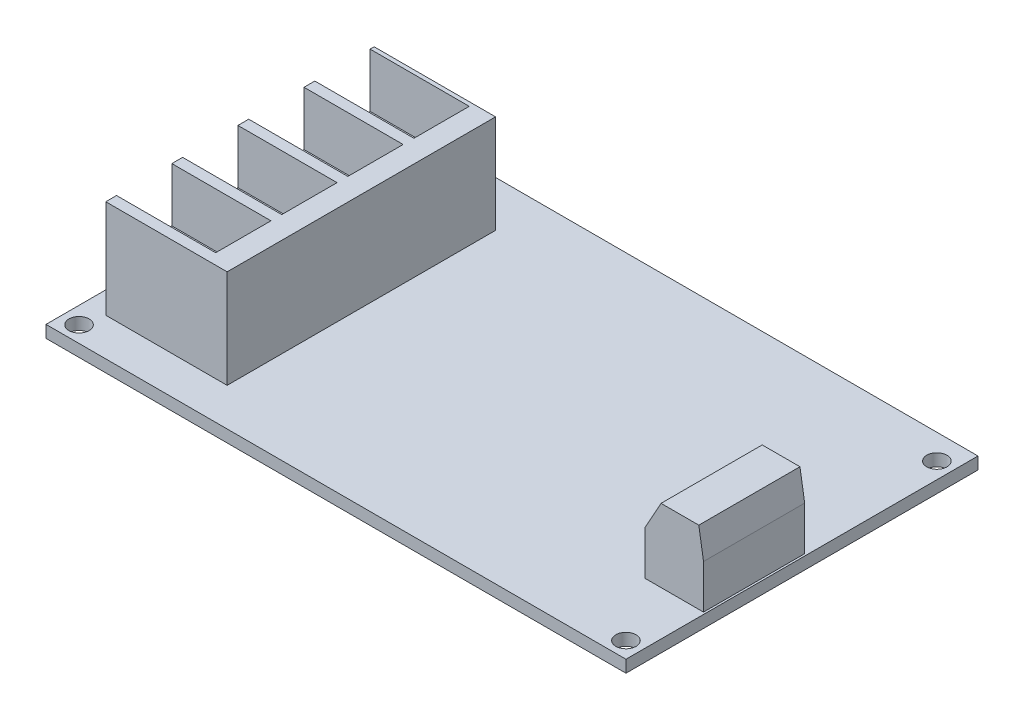
ISO-10303-21;
HEADER;
FILE_DESCRIPTION(('STEP AP214'),'2;1');
FILE_NAME('part.step','',(''),(''),'','','');
FILE_SCHEMA(('AUTOMOTIVE_DESIGN { 1 0 10303 214 1 1 1 1 }'));
ENDSEC;
DATA;
#1=APPLICATION_CONTEXT('core data for automotive mechanical design processes');
#2=APPLICATION_PROTOCOL_DEFINITION('international standard','automotive_design',2000,#1);
#3=PRODUCT_CONTEXT('',#1,'mechanical');
#4=PRODUCT('Part','Part','',(#3));
#5=PRODUCT_RELATED_PRODUCT_CATEGORY('part','',(#4));
#6=PRODUCT_DEFINITION_FORMATION('','',#4);
#7=PRODUCT_DEFINITION_CONTEXT('part definition',#1,'design');
#8=PRODUCT_DEFINITION('design','',#6,#7);
#9=PRODUCT_DEFINITION_SHAPE('','',#8);
#10=(LENGTH_UNIT() NAMED_UNIT(*) SI_UNIT(.MILLI.,.METRE.));
#11=(NAMED_UNIT(*) PLANE_ANGLE_UNIT() SI_UNIT($,.RADIAN.));
#12=(NAMED_UNIT(*) SI_UNIT($,.STERADIAN.) SOLID_ANGLE_UNIT());
#13=UNCERTAINTY_MEASURE_WITH_UNIT(LENGTH_MEASURE(1.E-05),#10,'distance_accuracy_value','');
#14=(GEOMETRIC_REPRESENTATION_CONTEXT(3) GLOBAL_UNCERTAINTY_ASSIGNED_CONTEXT((#13)) GLOBAL_UNIT_ASSIGNED_CONTEXT((#10,
#11,#12)) REPRESENTATION_CONTEXT('',''));
#15=CARTESIAN_POINT('',(0.,0.,0.));
#16=DIRECTION('',(0.,0.,1.));
#17=DIRECTION('',(1.,0.,0.));
#18=AXIS2_PLACEMENT_3D('',#15,#16,#17);
#19=CARTESIAN_POINT('',(3.26,16.38,-45.4));
#20=DIRECTION('',(1.,0.,0.));
#21=DIRECTION('',(0.,0.,-1.));
#22=AXIS2_PLACEMENT_3D('',#19,#20,#21);
#23=PLANE('',#22);
#24=DIRECTION('',(0.,0.,1.));
#25=VECTOR('',#24,1.);
#26=CARTESIAN_POINT('',(3.26,8.38,-7.2));
#27=LINE('',#26,#25);
#28=CARTESIAN_POINT('',(3.26,8.38,-15.4));
#29=VERTEX_POINT('',#28);
#30=CARTESIAN_POINT('',(3.26,8.38,-7.2));
#31=VERTEX_POINT('',#30);
#32=EDGE_CURVE('E201',#29,#31,#27,.T.);
#33=ORIENTED_EDGE('',*,*,#32,.F.);
#34=DIRECTION('',(0.,1.,0.));
#35=VECTOR('',#34,1.);
#36=CARTESIAN_POINT('',(3.26,8.38,-15.4));
#37=LINE('',#36,#35);
#38=CARTESIAN_POINT('',(3.26,16.38,-15.4));
#39=VERTEX_POINT('',#38);
#40=EDGE_CURVE('E320',#29,#39,#37,.T.);
#41=ORIENTED_EDGE('',*,*,#40,.T.);
#42=DIRECTION('',(0.,0.,1.));
#43=VECTOR('',#42,1.);
#44=CARTESIAN_POINT('',(3.26,16.38,-45.4));
#45=LINE('',#44,#43);
#46=CARTESIAN_POINT('',(3.25999999999997,16.38,-17.));
#47=VERTEX_POINT('',#46);
#48=EDGE_CURVE('E562',#47,#39,#45,.T.);
#49=ORIENTED_EDGE('',*,*,#48,.F.);
#50=DIRECTION('',(0.,1.,0.));
#51=VECTOR('',#50,1.);
#52=CARTESIAN_POINT('',(3.25999999999997,8.38,-17.));
#53=LINE('',#52,#51);
#54=CARTESIAN_POINT('',(3.25999999999997,8.38,-17.));
#55=VERTEX_POINT('',#54);
#56=EDGE_CURVE('E229',#55,#47,#53,.T.);
#57=ORIENTED_EDGE('',*,*,#56,.F.);
#58=DIRECTION('',(0.,0.,1.));
#59=VECTOR('',#58,1.);
#60=CARTESIAN_POINT('',(3.25999999999997,8.38,-17.));
#61=LINE('',#60,#59);
#62=CARTESIAN_POINT('',(3.25999999999997,8.38,-25.2));
#63=VERTEX_POINT('',#62);
#64=EDGE_CURVE('E223',#63,#55,#61,.T.);
#65=ORIENTED_EDGE('',*,*,#64,.F.);
#66=DIRECTION('',(0.,1.,0.));
#67=VECTOR('',#66,1.);
#68=CARTESIAN_POINT('',(3.25999999999997,8.38,-25.2));
#69=LINE('',#68,#67);
#70=CARTESIAN_POINT('',(3.25999999999997,16.38,-25.2));
#71=VERTEX_POINT('',#70);
#72=EDGE_CURVE('E226',#63,#71,#69,.T.);
#73=ORIENTED_EDGE('',*,*,#72,.T.);
#74=CARTESIAN_POINT('',(3.25999999999993,16.38,-26.8));
#75=VERTEX_POINT('',#74);
#76=EDGE_CURVE('E565',#75,#71,#45,.T.);
#77=ORIENTED_EDGE('',*,*,#76,.F.);
#78=DIRECTION('',(0.,1.,0.));
#79=VECTOR('',#78,1.);
#80=CARTESIAN_POINT('',(3.25999999999993,8.38,-26.8));
#81=LINE('',#80,#79);
#82=CARTESIAN_POINT('',(3.25999999999993,8.38,-26.8));
#83=VERTEX_POINT('',#82);
#84=EDGE_CURVE('E257',#83,#75,#81,.T.);
#85=ORIENTED_EDGE('',*,*,#84,.F.);
#86=DIRECTION('',(0.,0.,1.));
#87=VECTOR('',#86,1.);
#88=CARTESIAN_POINT('',(3.25999999999993,8.38,-26.8));
#89=LINE('',#88,#87);
#90=CARTESIAN_POINT('',(3.25999999999993,8.38,-35.));
#91=VERTEX_POINT('',#90);
#92=EDGE_CURVE('E251',#91,#83,#89,.T.);
#93=ORIENTED_EDGE('',*,*,#92,.F.);
#94=DIRECTION('',(0.,1.,0.));
#95=VECTOR('',#94,1.);
#96=CARTESIAN_POINT('',(3.25999999999993,8.38,-35.));
#97=LINE('',#96,#95);
#98=CARTESIAN_POINT('',(3.25999999999993,16.38,-35.));
#99=VERTEX_POINT('',#98);
#100=EDGE_CURVE('E254',#91,#99,#97,.T.);
#101=ORIENTED_EDGE('',*,*,#100,.T.);
#102=CARTESIAN_POINT('',(3.2599999999999,16.38,-36.6));
#103=VERTEX_POINT('',#102);
#104=EDGE_CURVE('E309',#103,#99,#45,.T.);
#105=ORIENTED_EDGE('',*,*,#104,.F.);
#106=DIRECTION('',(0.,1.,0.));
#107=VECTOR('',#106,1.);
#108=CARTESIAN_POINT('',(3.2599999999999,8.38,-36.6));
#109=LINE('',#108,#107);
#110=CARTESIAN_POINT('',(3.2599999999999,8.38,-36.6));
#111=VERTEX_POINT('',#110);
#112=EDGE_CURVE('E286',#111,#103,#109,.T.);
#113=ORIENTED_EDGE('',*,*,#112,.F.);
#114=DIRECTION('',(0.,0.,1.));
#115=VECTOR('',#114,1.);
#116=CARTESIAN_POINT('',(3.2599999999999,8.38,-36.6));
#117=LINE('',#116,#115);
#118=CARTESIAN_POINT('',(3.2599999999999,8.38,-44.8));
#119=VERTEX_POINT('',#118);
#120=EDGE_CURVE('E280',#119,#111,#117,.T.);
#121=ORIENTED_EDGE('',*,*,#120,.F.);
#122=DIRECTION('',(0.,1.,0.));
#123=VECTOR('',#122,1.);
#124=CARTESIAN_POINT('',(3.2599999999999,8.38,-44.8));
#125=LINE('',#124,#123);
#126=CARTESIAN_POINT('',(3.2599999999999,16.38,-44.8));
#127=VERTEX_POINT('',#126);
#128=EDGE_CURVE('E283',#119,#127,#125,.T.);
#129=ORIENTED_EDGE('',*,*,#128,.T.);
#130=CARTESIAN_POINT('',(3.26,16.38,-45.4));
#131=VERTEX_POINT('',#130);
#132=EDGE_CURVE('E305',#131,#127,#45,.T.);
#133=ORIENTED_EDGE('',*,*,#132,.F.);
#134=DIRECTION('',(0.,-1.,0.));
#135=VECTOR('',#134,1.);
#136=CARTESIAN_POINT('',(3.26,16.38,-45.4));
#137=LINE('',#136,#135);
#138=CARTESIAN_POINT('',(3.26,1.8,-45.4));
#139=VERTEX_POINT('',#138);
#140=EDGE_CURVE('E315',#131,#139,#137,.T.);
#141=ORIENTED_EDGE('',*,*,#140,.T.);
#142=DIRECTION('',(0.,0.,1.));
#143=VECTOR('',#142,1.);
#144=CARTESIAN_POINT('',(3.26,1.8,-45.4));
#145=LINE('',#144,#143);
#146=CARTESIAN_POINT('',(3.26,1.8,-5.6));
#147=VERTEX_POINT('',#146);
#148=EDGE_CURVE('E316',#139,#147,#145,.T.);
#149=ORIENTED_EDGE('',*,*,#148,.T.);
#150=DIRECTION('',(0.,-1.,0.));
#151=VECTOR('',#150,1.);
#152=CARTESIAN_POINT('',(3.26,16.38,-5.6));
#153=LINE('',#152,#151);
#154=CARTESIAN_POINT('',(3.26,16.38,-5.6));
#155=VERTEX_POINT('',#154);
#156=EDGE_CURVE('E12',#155,#147,#153,.T.);
#157=ORIENTED_EDGE('',*,*,#156,.F.);
#158=CARTESIAN_POINT('',(3.26,16.38,-7.20000000000001));
#159=VERTEX_POINT('',#158);
#160=EDGE_CURVE('E214',#159,#155,#45,.T.);
#161=ORIENTED_EDGE('',*,*,#160,.F.);
#162=DIRECTION('',(0.,1.,0.));
#163=VECTOR('',#162,1.);
#164=CARTESIAN_POINT('',(3.26,8.38,-7.2));
#165=LINE('',#164,#163);
#166=EDGE_CURVE('E194',#31,#159,#165,.T.);
#167=ORIENTED_EDGE('',*,*,#166,.F.);
#168=EDGE_LOOP('',(#33,#41,#49,#57,#65,#73,#77,#85,#93,#101,#105,#113,#121,#129,#133,#141,#149,
#157,#161,#167));
#169=FACE_BOUND('',#168,.T.);
#170=ADVANCED_FACE('F54',(#169),#23,.F.);
#171=CARTESIAN_POINT('',(3.26,16.38,-5.6));
#172=DIRECTION('',(0.,0.,-1.));
#173=DIRECTION('',(-1.,0.,0.));
#174=AXIS2_PLACEMENT_3D('',#171,#172,#173);
#175=PLANE('',#174);
#176=DIRECTION('',(1.,0.,0.));
#177=VECTOR('',#176,1.);
#178=CARTESIAN_POINT('',(3.26,1.8,-5.6));
#179=LINE('',#178,#177);
#180=CARTESIAN_POINT('',(21.26,1.8,-5.6));
#181=VERTEX_POINT('',#180);
#182=EDGE_CURVE('E319',#147,#181,#179,.T.);
#183=ORIENTED_EDGE('',*,*,#182,.T.);
#184=DIRECTION('',(0.,-1.,0.));
#185=VECTOR('',#184,1.);
#186=CARTESIAN_POINT('',(21.26,16.38,-5.6));
#187=LINE('',#186,#185);
#188=CARTESIAN_POINT('',(21.26,16.38,-5.6));
#189=VERTEX_POINT('',#188);
#190=EDGE_CURVE('E61',#189,#181,#187,.T.);
#191=ORIENTED_EDGE('',*,*,#190,.F.);
#192=DIRECTION('',(1.,0.,0.));
#193=VECTOR('',#192,1.);
#194=CARTESIAN_POINT('',(3.26,16.38,-5.6));
#195=LINE('',#194,#193);
#196=EDGE_CURVE('E308',#155,#189,#195,.T.);
#197=ORIENTED_EDGE('',*,*,#196,.F.);
#198=ORIENTED_EDGE('',*,*,#156,.T.);
#199=EDGE_LOOP('',(#183,#191,#197,#198));
#200=FACE_BOUND('',#199,.T.);
#201=ADVANCED_FACE('F354',(#200),#175,.F.);
#202=CARTESIAN_POINT('',(21.26,16.38,-45.4));
#203=DIRECTION('',(-1.,0.,0.));
#204=DIRECTION('',(0.,0.,1.));
#205=AXIS2_PLACEMENT_3D('',#202,#203,#204);
#206=PLANE('',#205);
#207=DIRECTION('',(0.,0.,-1.));
#208=VECTOR('',#207,1.);
#209=CARTESIAN_POINT('',(21.26,1.8,-45.4));
#210=LINE('',#209,#208);
#211=CARTESIAN_POINT('',(21.26,1.8,-45.4));
#212=VERTEX_POINT('',#211);
#213=EDGE_CURVE('E322',#181,#212,#210,.T.);
#214=ORIENTED_EDGE('',*,*,#213,.T.);
#215=DIRECTION('',(0.,-1.,0.));
#216=VECTOR('',#215,1.);
#217=CARTESIAN_POINT('',(21.26,16.38,-45.4));
#218=LINE('',#217,#216);
#219=CARTESIAN_POINT('',(21.26,16.38,-45.4));
#220=VERTEX_POINT('',#219);
#221=EDGE_CURVE('E328',#220,#212,#218,.T.);
#222=ORIENTED_EDGE('',*,*,#221,.F.);
#223=DIRECTION('',(0.,0.,-1.));
#224=VECTOR('',#223,1.);
#225=CARTESIAN_POINT('',(21.26,16.38,-45.4));
#226=LINE('',#225,#224);
#227=EDGE_CURVE('E311',#189,#220,#226,.T.);
#228=ORIENTED_EDGE('',*,*,#227,.F.);
#229=ORIENTED_EDGE('',*,*,#190,.T.);
#230=EDGE_LOOP('',(#214,#222,#228,#229));
#231=FACE_BOUND('',#230,.T.);
#232=ADVANCED_FACE('F335',(#231),#206,.F.);
#233=CARTESIAN_POINT('',(3.26,16.38,-45.4));
#234=DIRECTION('',(0.,0.,1.));
#235=DIRECTION('',(1.,0.,0.));
#236=AXIS2_PLACEMENT_3D('',#233,#234,#235);
#237=PLANE('',#236);
#238=DIRECTION('',(-1.,0.,0.));
#239=VECTOR('',#238,1.);
#240=CARTESIAN_POINT('',(3.26,1.8,-45.4));
#241=LINE('',#240,#239);
#242=EDGE_CURVE('E324',#212,#139,#241,.T.);
#243=ORIENTED_EDGE('',*,*,#242,.T.);
#244=ORIENTED_EDGE('',*,*,#140,.F.);
#245=DIRECTION('',(-1.,0.,0.));
#246=VECTOR('',#245,1.);
#247=CARTESIAN_POINT('',(3.26,16.38,-45.4));
#248=LINE('',#247,#246);
#249=EDGE_CURVE('E313',#220,#131,#248,.T.);
#250=ORIENTED_EDGE('',*,*,#249,.F.);
#251=ORIENTED_EDGE('',*,*,#221,.T.);
#252=EDGE_LOOP('',(#243,#244,#250,#251));
#253=FACE_BOUND('',#252,.T.);
#254=ADVANCED_FACE('F345',(#253),#237,.F.);
#255=CARTESIAN_POINT('',(0.,16.38,0.));
#256=DIRECTION('',(0.,1.,0.));
#257=DIRECTION('',(0.,0.,1.));
#258=AXIS2_PLACEMENT_3D('',#255,#256,#257);
#259=PLANE('',#258);
#260=DIRECTION('',(-1.,0.,0.));
#261=VECTOR('',#260,1.);
#262=CARTESIAN_POINT('',(3.26,16.38,-15.4));
#263=LINE('',#262,#261);
#264=CARTESIAN_POINT('',(17.96,16.38,-15.4));
#265=VERTEX_POINT('',#264);
#266=EDGE_CURVE('E210',#265,#39,#263,.T.);
#267=ORIENTED_EDGE('',*,*,#266,.F.);
#268=DIRECTION('',(0.,0.,-1.));
#269=VECTOR('',#268,1.);
#270=CARTESIAN_POINT('',(17.96,16.38,-7.2));
#271=LINE('',#270,#269);
#272=CARTESIAN_POINT('',(17.96,16.38,-7.2));
#273=VERTEX_POINT('',#272);
#274=EDGE_CURVE('E558',#273,#265,#271,.T.);
#275=ORIENTED_EDGE('',*,*,#274,.F.);
#276=DIRECTION('',(1.,0.,0.));
#277=VECTOR('',#276,1.);
#278=CARTESIAN_POINT('',(3.26,16.38,-7.2));
#279=LINE('',#278,#277);
#280=EDGE_CURVE('E238',#159,#273,#279,.T.);
#281=ORIENTED_EDGE('',*,*,#280,.F.);
#282=ORIENTED_EDGE('',*,*,#160,.T.);
#283=ORIENTED_EDGE('',*,*,#196,.T.);
#284=ORIENTED_EDGE('',*,*,#227,.T.);
#285=ORIENTED_EDGE('',*,*,#249,.T.);
#286=ORIENTED_EDGE('',*,*,#132,.T.);
#287=DIRECTION('',(-1.,0.,0.));
#288=VECTOR('',#287,1.);
#289=CARTESIAN_POINT('',(3.2599999999999,16.38,-44.8));
#290=LINE('',#289,#288);
#291=CARTESIAN_POINT('',(17.9599999999999,16.38,-44.8));
#292=VERTEX_POINT('',#291);
#293=EDGE_CURVE('E288',#292,#127,#290,.T.);
#294=ORIENTED_EDGE('',*,*,#293,.F.);
#295=DIRECTION('',(0.,0.,-1.));
#296=VECTOR('',#295,1.);
#297=CARTESIAN_POINT('',(17.9599999999999,16.38,-36.6));
#298=LINE('',#297,#296);
#299=CARTESIAN_POINT('',(17.9599999999999,16.38,-36.6));
#300=VERTEX_POINT('',#299);
#301=EDGE_CURVE('E290',#300,#292,#298,.T.);
#302=ORIENTED_EDGE('',*,*,#301,.F.);
#303=DIRECTION('',(1.,0.,0.));
#304=VECTOR('',#303,1.);
#305=CARTESIAN_POINT('',(3.2599999999999,16.38,-36.6));
#306=LINE('',#305,#304);
#307=EDGE_CURVE('E259',#103,#300,#306,.T.);
#308=ORIENTED_EDGE('',*,*,#307,.F.);
#309=ORIENTED_EDGE('',*,*,#104,.T.);
#310=DIRECTION('',(-1.,0.,0.));
#311=VECTOR('',#310,1.);
#312=CARTESIAN_POINT('',(3.25999999999993,16.38,-35.));
#313=LINE('',#312,#311);
#314=CARTESIAN_POINT('',(17.9599999999999,16.38,-35.));
#315=VERTEX_POINT('',#314);
#316=EDGE_CURVE('E260',#315,#99,#313,.T.);
#317=ORIENTED_EDGE('',*,*,#316,.F.);
#318=DIRECTION('',(0.,0.,-1.));
#319=VECTOR('',#318,1.);
#320=CARTESIAN_POINT('',(17.9599999999999,16.38,-26.8));
#321=LINE('',#320,#319);
#322=CARTESIAN_POINT('',(17.9599999999999,16.38,-26.8));
#323=VERTEX_POINT('',#322);
#324=EDGE_CURVE('E262',#323,#315,#321,.T.);
#325=ORIENTED_EDGE('',*,*,#324,.F.);
#326=DIRECTION('',(1.,0.,0.));
#327=VECTOR('',#326,1.);
#328=CARTESIAN_POINT('',(3.25999999999993,16.38,-26.8));
#329=LINE('',#328,#327);
#330=EDGE_CURVE('E76',#75,#323,#329,.T.);
#331=ORIENTED_EDGE('',*,*,#330,.F.);
#332=ORIENTED_EDGE('',*,*,#76,.T.);
#333=DIRECTION('',(-1.,0.,0.));
#334=VECTOR('',#333,1.);
#335=CARTESIAN_POINT('',(3.25999999999997,16.38,-25.2));
#336=LINE('',#335,#334);
#337=CARTESIAN_POINT('',(17.96,16.38,-25.2));
#338=VERTEX_POINT('',#337);
#339=EDGE_CURVE('E231',#338,#71,#336,.T.);
#340=ORIENTED_EDGE('',*,*,#339,.F.);
#341=DIRECTION('',(0.,0.,-1.));
#342=VECTOR('',#341,1.);
#343=CARTESIAN_POINT('',(17.96,16.38,-17.));
#344=LINE('',#343,#342);
#345=CARTESIAN_POINT('',(17.96,16.38,-17.));
#346=VERTEX_POINT('',#345);
#347=EDGE_CURVE('E233',#346,#338,#344,.T.);
#348=ORIENTED_EDGE('',*,*,#347,.F.);
#349=DIRECTION('',(1.,0.,0.));
#350=VECTOR('',#349,1.);
#351=CARTESIAN_POINT('',(3.25999999999997,16.38,-17.));
#352=LINE('',#351,#350);
#353=EDGE_CURVE('E68',#47,#346,#352,.T.);
#354=ORIENTED_EDGE('',*,*,#353,.F.);
#355=ORIENTED_EDGE('',*,*,#48,.T.);
#356=EDGE_LOOP('',(#267,#275,#281,#282,#283,#284,#285,#286,#294,#302,#308,#309,#317,#325,#331,
#332,#340,#348,#354,#355));
#357=FACE_BOUND('',#356,.T.);
#358=ADVANCED_FACE('F352',(#357),#259,.T.);
#359=CARTESIAN_POINT('',(0.,1.8,0.));
#360=DIRECTION('',(0.,1.,0.));
#361=DIRECTION('',(0.,0.,1.));
#362=AXIS2_PLACEMENT_3D('',#359,#360,#361);
#363=PLANE('',#362);
#364=ORIENTED_EDGE('',*,*,#148,.F.);
#365=ORIENTED_EDGE('',*,*,#242,.F.);
#366=ORIENTED_EDGE('',*,*,#213,.F.);
#367=ORIENTED_EDGE('',*,*,#182,.F.);
#368=EDGE_LOOP('',(#364,#365,#366,#367));
#369=FACE_BOUND('',#368,.T.);
#370=ADVANCED_FACE('F342',(#369),#363,.F.);
#371=CARTESIAN_POINT('',(3.2599999999999,8.38,-36.6));
#372=DIRECTION('',(0.,0.,1.));
#373=DIRECTION('',(1.,0.,0.));
#374=AXIS2_PLACEMENT_3D('',#371,#372,#373);
#375=PLANE('',#374);
#376=ORIENTED_EDGE('',*,*,#307,.T.);
#377=DIRECTION('',(0.,1.,0.));
#378=VECTOR('',#377,1.);
#379=CARTESIAN_POINT('',(17.9599999999999,8.38,-36.6));
#380=LINE('',#379,#378);
#381=CARTESIAN_POINT('',(17.9599999999999,8.38,-36.6));
#382=VERTEX_POINT('',#381);
#383=EDGE_CURVE('E277',#382,#300,#380,.T.);
#384=ORIENTED_EDGE('',*,*,#383,.F.);
#385=DIRECTION('',(1.,0.,0.));
#386=VECTOR('',#385,1.);
#387=CARTESIAN_POINT('',(3.2599999999999,8.38,-36.6));
#388=LINE('',#387,#386);
#389=EDGE_CURVE('E291',#111,#382,#388,.T.);
#390=ORIENTED_EDGE('',*,*,#389,.F.);
#391=ORIENTED_EDGE('',*,*,#112,.T.);
#392=EDGE_LOOP('',(#376,#384,#390,#391));
#393=FACE_BOUND('',#392,.T.);
#394=ADVANCED_FACE('F366',(#393),#375,.F.);
#395=CARTESIAN_POINT('',(3.2599999999999,8.38,-44.8));
#396=DIRECTION('',(0.,0.,-1.));
#397=DIRECTION('',(-1.,0.,0.));
#398=AXIS2_PLACEMENT_3D('',#395,#396,#397);
#399=PLANE('',#398);
#400=ORIENTED_EDGE('',*,*,#293,.T.);
#401=ORIENTED_EDGE('',*,*,#128,.F.);
#402=DIRECTION('',(-1.,0.,0.));
#403=VECTOR('',#402,1.);
#404=CARTESIAN_POINT('',(3.2599999999999,8.38,-44.8));
#405=LINE('',#404,#403);
#406=CARTESIAN_POINT('',(17.9599999999999,8.38,-44.8));
#407=VERTEX_POINT('',#406);
#408=EDGE_CURVE('E297',#407,#119,#405,.T.);
#409=ORIENTED_EDGE('',*,*,#408,.F.);
#410=DIRECTION('',(0.,1.,0.));
#411=VECTOR('',#410,1.);
#412=CARTESIAN_POINT('',(17.9599999999999,8.38,-44.8));
#413=LINE('',#412,#411);
#414=EDGE_CURVE('E281',#407,#292,#413,.T.);
#415=ORIENTED_EDGE('',*,*,#414,.T.);
#416=EDGE_LOOP('',(#400,#401,#409,#415));
#417=FACE_BOUND('',#416,.T.);
#418=ADVANCED_FACE('F375',(#417),#399,.F.);
#419=CARTESIAN_POINT('',(17.9599999999999,8.38,-36.6));
#420=DIRECTION('',(1.,0.,0.));
#421=DIRECTION('',(0.,0.,-1.));
#422=AXIS2_PLACEMENT_3D('',#419,#420,#421);
#423=PLANE('',#422);
#424=ORIENTED_EDGE('',*,*,#301,.T.);
#425=ORIENTED_EDGE('',*,*,#414,.F.);
#426=DIRECTION('',(0.,0.,-1.));
#427=VECTOR('',#426,1.);
#428=CARTESIAN_POINT('',(17.9599999999999,8.38,-36.6));
#429=LINE('',#428,#427);
#430=EDGE_CURVE('E300',#382,#407,#429,.T.);
#431=ORIENTED_EDGE('',*,*,#430,.F.);
#432=ORIENTED_EDGE('',*,*,#383,.T.);
#433=EDGE_LOOP('',(#424,#425,#431,#432));
#434=FACE_BOUND('',#433,.T.);
#435=ADVANCED_FACE('F373',(#434),#423,.F.);
#436=CARTESIAN_POINT('',(0.,8.38,0.));
#437=DIRECTION('',(0.,1.,0.));
#438=DIRECTION('',(0.,0.,1.));
#439=AXIS2_PLACEMENT_3D('',#436,#437,#438);
#440=PLANE('',#439);
#441=ORIENTED_EDGE('',*,*,#389,.T.);
#442=ORIENTED_EDGE('',*,*,#430,.T.);
#443=ORIENTED_EDGE('',*,*,#408,.T.);
#444=ORIENTED_EDGE('',*,*,#120,.T.);
#445=EDGE_LOOP('',(#441,#442,#443,#444));
#446=FACE_BOUND('',#445,.T.);
#447=ADVANCED_FACE('F369',(#446),#440,.T.);
#448=CARTESIAN_POINT('',(3.25999999999993,8.38,-26.8));
#449=DIRECTION('',(0.,0.,1.));
#450=DIRECTION('',(1.,0.,0.));
#451=AXIS2_PLACEMENT_3D('',#448,#449,#450);
#452=PLANE('',#451);
#453=ORIENTED_EDGE('',*,*,#330,.T.);
#454=DIRECTION('',(0.,1.,0.));
#455=VECTOR('',#454,1.);
#456=CARTESIAN_POINT('',(17.9599999999999,8.38,-26.8));
#457=LINE('',#456,#455);
#458=CARTESIAN_POINT('',(17.9599999999999,8.38,-26.8));
#459=VERTEX_POINT('',#458);
#460=EDGE_CURVE('E249',#459,#323,#457,.T.);
#461=ORIENTED_EDGE('',*,*,#460,.F.);
#462=DIRECTION('',(1.,0.,0.));
#463=VECTOR('',#462,1.);
#464=CARTESIAN_POINT('',(3.25999999999993,8.38,-26.8));
#465=LINE('',#464,#463);
#466=EDGE_CURVE('E263',#83,#459,#465,.T.);
#467=ORIENTED_EDGE('',*,*,#466,.F.);
#468=ORIENTED_EDGE('',*,*,#84,.T.);
#469=EDGE_LOOP('',(#453,#461,#467,#468));
#470=FACE_BOUND('',#469,.T.);
#471=ADVANCED_FACE('F372',(#470),#452,.F.);
#472=CARTESIAN_POINT('',(3.25999999999993,8.38,-35.));
#473=DIRECTION('',(0.,0.,-1.));
#474=DIRECTION('',(-1.,0.,0.));
#475=AXIS2_PLACEMENT_3D('',#472,#473,#474);
#476=PLANE('',#475);
#477=ORIENTED_EDGE('',*,*,#316,.T.);
#478=ORIENTED_EDGE('',*,*,#100,.F.);
#479=DIRECTION('',(-1.,0.,0.));
#480=VECTOR('',#479,1.);
#481=CARTESIAN_POINT('',(3.25999999999993,8.38,-35.));
#482=LINE('',#481,#480);
#483=CARTESIAN_POINT('',(17.9599999999999,8.38,-35.));
#484=VERTEX_POINT('',#483);
#485=EDGE_CURVE('E269',#484,#91,#482,.T.);
#486=ORIENTED_EDGE('',*,*,#485,.F.);
#487=DIRECTION('',(0.,1.,0.));
#488=VECTOR('',#487,1.);
#489=CARTESIAN_POINT('',(17.9599999999999,8.38,-35.));
#490=LINE('',#489,#488);
#491=EDGE_CURVE('E252',#484,#315,#490,.T.);
#492=ORIENTED_EDGE('',*,*,#491,.T.);
#493=EDGE_LOOP('',(#477,#478,#486,#492));
#494=FACE_BOUND('',#493,.T.);
#495=ADVANCED_FACE('F391',(#494),#476,.F.);
#496=CARTESIAN_POINT('',(17.9599999999999,8.38,-26.8));
#497=DIRECTION('',(1.,0.,0.));
#498=DIRECTION('',(0.,0.,-1.));
#499=AXIS2_PLACEMENT_3D('',#496,#497,#498);
#500=PLANE('',#499);
#501=ORIENTED_EDGE('',*,*,#324,.T.);
#502=ORIENTED_EDGE('',*,*,#491,.F.);
#503=DIRECTION('',(0.,0.,-1.));
#504=VECTOR('',#503,1.);
#505=CARTESIAN_POINT('',(17.9599999999999,8.38,-26.8));
#506=LINE('',#505,#504);
#507=EDGE_CURVE('E272',#459,#484,#506,.T.);
#508=ORIENTED_EDGE('',*,*,#507,.F.);
#509=ORIENTED_EDGE('',*,*,#460,.T.);
#510=EDGE_LOOP('',(#501,#502,#508,#509));
#511=FACE_BOUND('',#510,.T.);
#512=ADVANCED_FACE('F389',(#511),#500,.F.);
#513=CARTESIAN_POINT('',(0.,8.38,0.));
#514=DIRECTION('',(0.,1.,0.));
#515=DIRECTION('',(0.,0.,1.));
#516=AXIS2_PLACEMENT_3D('',#513,#514,#515);
#517=PLANE('',#516);
#518=ORIENTED_EDGE('',*,*,#466,.T.);
#519=ORIENTED_EDGE('',*,*,#507,.T.);
#520=ORIENTED_EDGE('',*,*,#485,.T.);
#521=ORIENTED_EDGE('',*,*,#92,.T.);
#522=EDGE_LOOP('',(#518,#519,#520,#521));
#523=FACE_BOUND('',#522,.T.);
#524=ADVANCED_FACE('F385',(#523),#517,.T.);
#525=CARTESIAN_POINT('',(3.25999999999997,8.38,-17.));
#526=DIRECTION('',(0.,0.,1.));
#527=DIRECTION('',(1.,0.,0.));
#528=AXIS2_PLACEMENT_3D('',#525,#526,#527);
#529=PLANE('',#528);
#530=ORIENTED_EDGE('',*,*,#353,.T.);
#531=DIRECTION('',(0.,1.,0.));
#532=VECTOR('',#531,1.);
#533=CARTESIAN_POINT('',(17.96,8.38,-17.));
#534=LINE('',#533,#532);
#535=CARTESIAN_POINT('',(17.96,8.38,-17.));
#536=VERTEX_POINT('',#535);
#537=EDGE_CURVE('E221',#536,#346,#534,.T.);
#538=ORIENTED_EDGE('',*,*,#537,.F.);
#539=DIRECTION('',(1.,0.,0.));
#540=VECTOR('',#539,1.);
#541=CARTESIAN_POINT('',(3.25999999999997,8.38,-17.));
#542=LINE('',#541,#540);
#543=EDGE_CURVE('E234',#55,#536,#542,.T.);
#544=ORIENTED_EDGE('',*,*,#543,.F.);
#545=ORIENTED_EDGE('',*,*,#56,.T.);
#546=EDGE_LOOP('',(#530,#538,#544,#545));
#547=FACE_BOUND('',#546,.T.);
#548=ADVANCED_FACE('F388',(#547),#529,.F.);
#549=CARTESIAN_POINT('',(3.25999999999997,8.38,-25.2));
#550=DIRECTION('',(0.,0.,-1.));
#551=DIRECTION('',(-1.,0.,0.));
#552=AXIS2_PLACEMENT_3D('',#549,#550,#551);
#553=PLANE('',#552);
#554=ORIENTED_EDGE('',*,*,#339,.T.);
#555=ORIENTED_EDGE('',*,*,#72,.F.);
#556=DIRECTION('',(-1.,0.,0.));
#557=VECTOR('',#556,1.);
#558=CARTESIAN_POINT('',(3.25999999999997,8.38,-25.2));
#559=LINE('',#558,#557);
#560=CARTESIAN_POINT('',(17.96,8.38,-25.2));
#561=VERTEX_POINT('',#560);
#562=EDGE_CURVE('E241',#561,#63,#559,.T.);
#563=ORIENTED_EDGE('',*,*,#562,.F.);
#564=DIRECTION('',(0.,1.,0.));
#565=VECTOR('',#564,1.);
#566=CARTESIAN_POINT('',(17.96,8.38,-25.2));
#567=LINE('',#566,#565);
#568=EDGE_CURVE('E224',#561,#338,#567,.T.);
#569=ORIENTED_EDGE('',*,*,#568,.T.);
#570=EDGE_LOOP('',(#554,#555,#563,#569));
#571=FACE_BOUND('',#570,.T.);
#572=ADVANCED_FACE('F406',(#571),#553,.F.);
#573=CARTESIAN_POINT('',(17.96,8.38,-17.));
#574=DIRECTION('',(1.,0.,0.));
#575=DIRECTION('',(0.,0.,-1.));
#576=AXIS2_PLACEMENT_3D('',#573,#574,#575);
#577=PLANE('',#576);
#578=ORIENTED_EDGE('',*,*,#347,.T.);
#579=ORIENTED_EDGE('',*,*,#568,.F.);
#580=DIRECTION('',(0.,0.,-1.));
#581=VECTOR('',#580,1.);
#582=CARTESIAN_POINT('',(17.96,8.38,-17.));
#583=LINE('',#582,#581);
#584=EDGE_CURVE('E244',#536,#561,#583,.T.);
#585=ORIENTED_EDGE('',*,*,#584,.F.);
#586=ORIENTED_EDGE('',*,*,#537,.T.);
#587=EDGE_LOOP('',(#578,#579,#585,#586));
#588=FACE_BOUND('',#587,.T.);
#589=ADVANCED_FACE('F404',(#588),#577,.F.);
#590=CARTESIAN_POINT('',(0.,8.38,0.));
#591=DIRECTION('',(0.,1.,0.));
#592=DIRECTION('',(0.,0.,1.));
#593=AXIS2_PLACEMENT_3D('',#590,#591,#592);
#594=PLANE('',#593);
#595=ORIENTED_EDGE('',*,*,#543,.T.);
#596=ORIENTED_EDGE('',*,*,#584,.T.);
#597=ORIENTED_EDGE('',*,*,#562,.T.);
#598=ORIENTED_EDGE('',*,*,#64,.T.);
#599=EDGE_LOOP('',(#595,#596,#597,#598));
#600=FACE_BOUND('',#599,.T.);
#601=ADVANCED_FACE('F400',(#600),#594,.T.);
#602=CARTESIAN_POINT('',(3.26,8.38,-15.4));
#603=DIRECTION('',(0.,0.,-1.));
#604=DIRECTION('',(-1.,0.,0.));
#605=AXIS2_PLACEMENT_3D('',#602,#603,#604);
#606=PLANE('',#605);
#607=ORIENTED_EDGE('',*,*,#266,.T.);
#608=ORIENTED_EDGE('',*,*,#40,.F.);
#609=DIRECTION('',(-1.,0.,0.));
#610=VECTOR('',#609,1.);
#611=CARTESIAN_POINT('',(3.26,8.38,-15.4));
#612=LINE('',#611,#610);
#613=CARTESIAN_POINT('',(17.96,8.38,-15.4));
#614=VERTEX_POINT('',#613);
#615=EDGE_CURVE('E207',#614,#29,#612,.T.);
#616=ORIENTED_EDGE('',*,*,#615,.F.);
#617=DIRECTION('',(0.,1.,0.));
#618=VECTOR('',#617,1.);
#619=CARTESIAN_POINT('',(17.96,8.38,-15.4));
#620=LINE('',#619,#618);
#621=EDGE_CURVE('E216',#614,#265,#620,.T.);
#622=ORIENTED_EDGE('',*,*,#621,.T.);
#623=EDGE_LOOP('',(#607,#608,#616,#622));
#624=FACE_BOUND('',#623,.T.);
#625=ADVANCED_FACE('F403',(#624),#606,.F.);
#626=CARTESIAN_POINT('',(17.96,8.38,-7.2));
#627=DIRECTION('',(1.,0.,0.));
#628=DIRECTION('',(0.,0.,-1.));
#629=AXIS2_PLACEMENT_3D('',#626,#627,#628);
#630=PLANE('',#629);
#631=ORIENTED_EDGE('',*,*,#274,.T.);
#632=ORIENTED_EDGE('',*,*,#621,.F.);
#633=DIRECTION('',(0.,0.,-1.));
#634=VECTOR('',#633,1.);
#635=CARTESIAN_POINT('',(17.96,8.38,-7.2));
#636=LINE('',#635,#634);
#637=CARTESIAN_POINT('',(17.96,8.38,-7.2));
#638=VERTEX_POINT('',#637);
#639=EDGE_CURVE('E200',#638,#614,#636,.T.);
#640=ORIENTED_EDGE('',*,*,#639,.F.);
#641=DIRECTION('',(0.,1.,0.));
#642=VECTOR('',#641,1.);
#643=CARTESIAN_POINT('',(17.96,8.38,-7.2));
#644=LINE('',#643,#642);
#645=EDGE_CURVE('E196',#638,#273,#644,.T.);
#646=ORIENTED_EDGE('',*,*,#645,.T.);
#647=EDGE_LOOP('',(#631,#632,#640,#646));
#648=FACE_BOUND('',#647,.T.);
#649=ADVANCED_FACE('F417',(#648),#630,.F.);
#650=CARTESIAN_POINT('',(3.26,8.38,-7.2));
#651=DIRECTION('',(0.,0.,1.));
#652=DIRECTION('',(1.,0.,0.));
#653=AXIS2_PLACEMENT_3D('',#650,#651,#652);
#654=PLANE('',#653);
#655=ORIENTED_EDGE('',*,*,#280,.T.);
#656=ORIENTED_EDGE('',*,*,#645,.F.);
#657=DIRECTION('',(1.,0.,0.));
#658=VECTOR('',#657,1.);
#659=CARTESIAN_POINT('',(3.26,8.38,-7.2));
#660=LINE('',#659,#658);
#661=EDGE_CURVE('E189',#31,#638,#660,.T.);
#662=ORIENTED_EDGE('',*,*,#661,.F.);
#663=ORIENTED_EDGE('',*,*,#166,.T.);
#664=EDGE_LOOP('',(#655,#656,#662,#663));
#665=FACE_BOUND('',#664,.T.);
#666=ADVANCED_FACE('F192',(#665),#654,.F.);
#667=CARTESIAN_POINT('',(0.,8.38,0.));
#668=DIRECTION('',(0.,-1.,0.));
#669=DIRECTION('',(0.,0.,-1.));
#670=AXIS2_PLACEMENT_3D('',#667,#668,#669);
#671=PLANE('',#670);
#672=ORIENTED_EDGE('',*,*,#32,.T.);
#673=ORIENTED_EDGE('',*,*,#661,.T.);
#674=ORIENTED_EDGE('',*,*,#639,.T.);
#675=ORIENTED_EDGE('',*,*,#615,.T.);
#676=EDGE_LOOP('',(#672,#673,#674,#675));
#677=FACE_BOUND('',#676,.T.);
#678=ADVANCED_FACE('F205',(#677),#671,.F.);
#679=CLOSED_SHELL('',(#170,#201,#232,#254,#358,#370,#394,#418,#435,#447,#471,#495,#512,#524,
#548,#572,#589,#601,#625,#649,#666,#678));
#680=MANIFOLD_SOLID_BREP('B2',#679);
#681=CARTESIAN_POINT('',(77.,8.3,-26.8));
#682=DIRECTION('',(1.,0.,0.));
#683=DIRECTION('',(0.,0.,-1.));
#684=AXIS2_PLACEMENT_3D('',#681,#682,#683);
#685=PLANE('',#684);
#686=DIRECTION('',(0.,0.,1.));
#687=VECTOR('',#686,1.);
#688=CARTESIAN_POINT('',(77.,1.8,-26.8));
#689=LINE('',#688,#687);
#690=CARTESIAN_POINT('',(77.,1.8,-26.8));
#691=VERTEX_POINT('',#690);
#692=CARTESIAN_POINT('',(77.,1.8,-11.8));
#693=VERTEX_POINT('',#692);
#694=EDGE_CURVE('E679',#691,#693,#689,.T.);
#695=ORIENTED_EDGE('',*,*,#694,.T.);
#696=DIRECTION('',(0.,-1.,0.));
#697=VECTOR('',#696,1.);
#698=CARTESIAN_POINT('',(77.,8.3,-11.8));
#699=LINE('',#698,#697);
#700=CARTESIAN_POINT('',(77.,8.3,-11.8));
#701=VERTEX_POINT('',#700);
#702=EDGE_CURVE('E52',#701,#693,#699,.T.);
#703=ORIENTED_EDGE('',*,*,#702,.F.);
#704=DIRECTION('',(0.,0.,1.));
#705=VECTOR('',#704,1.);
#706=CARTESIAN_POINT('',(77.,8.3,-26.8));
#707=LINE('',#706,#705);
#708=CARTESIAN_POINT('',(77.,8.3,-26.8));
#709=VERTEX_POINT('',#708);
#710=EDGE_CURVE('E662',#709,#701,#707,.T.);
#711=ORIENTED_EDGE('',*,*,#710,.F.);
#712=DIRECTION('',(0.,-1.,0.));
#713=VECTOR('',#712,1.);
#714=CARTESIAN_POINT('',(77.,8.3,-26.8));
#715=LINE('',#714,#713);
#716=EDGE_CURVE('E661',#709,#691,#715,.T.);
#717=ORIENTED_EDGE('',*,*,#716,.T.);
#718=EDGE_LOOP('',(#695,#703,#711,#717));
#719=FACE_BOUND('',#718,.T.);
#720=ADVANCED_FACE('F599',(#719),#685,.F.);
#721=CARTESIAN_POINT('',(77.,8.3,-11.8));
#722=DIRECTION('',(0.,0.,-1.));
#723=DIRECTION('',(-1.,0.,0.));
#724=AXIS2_PLACEMENT_3D('',#721,#722,#723);
#725=PLANE('',#724);
#726=DIRECTION('',(0.,-1.,0.));
#727=VECTOR('',#726,1.);
#728=CARTESIAN_POINT('',(85.7,8.3,-11.8));
#729=LINE('',#728,#727);
#730=CARTESIAN_POINT('',(85.7,8.3,-11.8));
#731=VERTEX_POINT('',#730);
#732=CARTESIAN_POINT('',(85.7,1.8,-11.8));
#733=VERTEX_POINT('',#732);
#734=EDGE_CURVE('E606',#731,#733,#729,.T.);
#735=ORIENTED_EDGE('',*,*,#734,.F.);
#736=DIRECTION('',(0.159950808001546,-0.98712498652382,0.));
#737=VECTOR('',#736,1.);
#738=CARTESIAN_POINT('',(85.,12.62,-11.8));
#739=LINE('',#738,#737);
#740=CARTESIAN_POINT('',(85.,12.62,-11.8));
#741=VERTEX_POINT('',#740);
#742=EDGE_CURVE('E659',#741,#731,#739,.T.);
#743=ORIENTED_EDGE('',*,*,#742,.F.);
#744=DIRECTION('',(1.,0.,0.));
#745=VECTOR('',#744,1.);
#746=CARTESIAN_POINT('',(79.4,12.62,-11.8));
#747=LINE('',#746,#745);
#748=CARTESIAN_POINT('',(79.4,12.62,-11.8));
#749=VERTEX_POINT('',#748);
#750=EDGE_CURVE('E686',#749,#741,#747,.T.);
#751=ORIENTED_EDGE('',*,*,#750,.F.);
#752=DIRECTION('',(-0.485642931178632,-0.874157276121538,0.));
#753=VECTOR('',#752,1.);
#754=CARTESIAN_POINT('',(79.4,12.62,-11.8));
#755=LINE('',#754,#753);
#756=EDGE_CURVE('E692',#749,#701,#755,.T.);
#757=ORIENTED_EDGE('',*,*,#756,.T.);
#758=ORIENTED_EDGE('',*,*,#702,.T.);
#759=DIRECTION('',(1.,0.,0.));
#760=VECTOR('',#759,1.);
#761=CARTESIAN_POINT('',(77.,1.8,-11.8));
#762=LINE('',#761,#760);
#763=EDGE_CURVE('E677',#693,#733,#762,.T.);
#764=ORIENTED_EDGE('',*,*,#763,.T.);
#765=EDGE_LOOP('',(#735,#743,#751,#757,#758,#764));
#766=FACE_BOUND('',#765,.T.);
#767=ADVANCED_FACE('F700',(#766),#725,.F.);
#768=CARTESIAN_POINT('',(85.7,8.3,-26.8));
#769=DIRECTION('',(-1.,0.,0.));
#770=DIRECTION('',(0.,0.,1.));
#771=AXIS2_PLACEMENT_3D('',#768,#769,#770);
#772=PLANE('',#771);
#773=DIRECTION('',(0.,0.,-1.));
#774=VECTOR('',#773,1.);
#775=CARTESIAN_POINT('',(85.7,1.8,-26.8));
#776=LINE('',#775,#774);
#777=CARTESIAN_POINT('',(85.7,1.8,-26.8));
#778=VERTEX_POINT('',#777);
#779=EDGE_CURVE('E621',#733,#778,#776,.T.);
#780=ORIENTED_EDGE('',*,*,#779,.T.);
#781=DIRECTION('',(0.,-1.,0.));
#782=VECTOR('',#781,1.);
#783=CARTESIAN_POINT('',(85.7,8.3,-26.8));
#784=LINE('',#783,#782);
#785=CARTESIAN_POINT('',(85.7,8.3,-26.8));
#786=VERTEX_POINT('',#785);
#787=EDGE_CURVE('E666',#786,#778,#784,.T.);
#788=ORIENTED_EDGE('',*,*,#787,.F.);
#789=DIRECTION('',(0.,0.,-1.));
#790=VECTOR('',#789,1.);
#791=CARTESIAN_POINT('',(85.7,8.3,-26.8));
#792=LINE('',#791,#790);
#793=EDGE_CURVE('E653',#731,#786,#792,.T.);
#794=ORIENTED_EDGE('',*,*,#793,.F.);
#795=ORIENTED_EDGE('',*,*,#734,.T.);
#796=EDGE_LOOP('',(#780,#788,#794,#795));
#797=FACE_BOUND('',#796,.T.);
#798=ADVANCED_FACE('F671',(#797),#772,.F.);
#799=CARTESIAN_POINT('',(77.,8.3,-26.8));
#800=DIRECTION('',(0.,0.,1.));
#801=DIRECTION('',(1.,0.,0.));
#802=AXIS2_PLACEMENT_3D('',#799,#800,#801);
#803=PLANE('',#802);
#804=ORIENTED_EDGE('',*,*,#716,.F.);
#805=DIRECTION('',(-0.485642931178632,-0.874157276121538,0.));
#806=VECTOR('',#805,1.);
#807=CARTESIAN_POINT('',(79.4,12.62,-26.8));
#808=LINE('',#807,#806);
#809=CARTESIAN_POINT('',(79.4,12.62,-26.8));
#810=VERTEX_POINT('',#809);
#811=EDGE_CURVE('E693',#810,#709,#808,.T.);
#812=ORIENTED_EDGE('',*,*,#811,.F.);
#813=DIRECTION('',(-1.,0.,0.));
#814=VECTOR('',#813,1.);
#815=CARTESIAN_POINT('',(79.4,12.62,-26.8));
#816=LINE('',#815,#814);
#817=CARTESIAN_POINT('',(85.,12.62,-26.8));
#818=VERTEX_POINT('',#817);
#819=EDGE_CURVE('E669',#818,#810,#816,.T.);
#820=ORIENTED_EDGE('',*,*,#819,.F.);
#821=DIRECTION('',(0.159950808001546,-0.98712498652382,0.));
#822=VECTOR('',#821,1.);
#823=CARTESIAN_POINT('',(85.,12.62,-26.8));
#824=LINE('',#823,#822);
#825=EDGE_CURVE('E656',#818,#786,#824,.T.);
#826=ORIENTED_EDGE('',*,*,#825,.T.);
#827=ORIENTED_EDGE('',*,*,#787,.T.);
#828=DIRECTION('',(-1.,0.,0.));
#829=VECTOR('',#828,1.);
#830=CARTESIAN_POINT('',(77.,1.8,-26.8));
#831=LINE('',#830,#829);
#832=EDGE_CURVE('E613',#778,#691,#831,.T.);
#833=ORIENTED_EDGE('',*,*,#832,.T.);
#834=EDGE_LOOP('',(#804,#812,#820,#826,#827,#833));
#835=FACE_BOUND('',#834,.T.);
#836=ADVANCED_FACE('F665',(#835),#803,.F.);
#837=CARTESIAN_POINT('',(0.,1.8,0.));
#838=DIRECTION('',(0.,1.,0.));
#839=DIRECTION('',(0.,0.,1.));
#840=AXIS2_PLACEMENT_3D('',#837,#838,#839);
#841=PLANE('',#840);
#842=ORIENTED_EDGE('',*,*,#694,.F.);
#843=ORIENTED_EDGE('',*,*,#832,.F.);
#844=ORIENTED_EDGE('',*,*,#779,.F.);
#845=ORIENTED_EDGE('',*,*,#763,.F.);
#846=EDGE_LOOP('',(#842,#843,#844,#845));
#847=FACE_BOUND('',#846,.T.);
#848=ADVANCED_FACE('F706',(#847),#841,.F.);
#849=CARTESIAN_POINT('',(0.,12.62,0.));
#850=DIRECTION('',(0.,1.,0.));
#851=DIRECTION('',(0.,0.,1.));
#852=AXIS2_PLACEMENT_3D('',#849,#850,#851);
#853=PLANE('',#852);
#854=DIRECTION('',(0.,0.,1.));
#855=VECTOR('',#854,1.);
#856=CARTESIAN_POINT('',(79.4,12.62,-26.8));
#857=LINE('',#856,#855);
#858=EDGE_CURVE('E689',#810,#749,#857,.T.);
#859=ORIENTED_EDGE('',*,*,#858,.T.);
#860=ORIENTED_EDGE('',*,*,#750,.T.);
#861=DIRECTION('',(0.,0.,-1.));
#862=VECTOR('',#861,1.);
#863=CARTESIAN_POINT('',(85.,12.62,-26.8));
#864=LINE('',#863,#862);
#865=EDGE_CURVE('E684',#741,#818,#864,.T.);
#866=ORIENTED_EDGE('',*,*,#865,.T.);
#867=ORIENTED_EDGE('',*,*,#819,.T.);
#868=EDGE_LOOP('',(#859,#860,#866,#867));
#869=FACE_BOUND('',#868,.T.);
#870=ADVANCED_FACE('F708',(#869),#853,.T.);
#871=CARTESIAN_POINT('',(79.4,12.62,-19.3));
#872=DIRECTION('',(-0.874157276121538,0.485642931178632,0.));
#873=DIRECTION('',(-0.485642931178632,-0.874157276121538,0.));
#874=AXIS2_PLACEMENT_3D('',#871,#872,#873);
#875=PLANE('',#874);
#876=ORIENTED_EDGE('',*,*,#811,.T.);
#877=ORIENTED_EDGE('',*,*,#710,.T.);
#878=ORIENTED_EDGE('',*,*,#756,.F.);
#879=ORIENTED_EDGE('',*,*,#858,.F.);
#880=EDGE_LOOP('',(#876,#877,#878,#879));
#881=FACE_BOUND('',#880,.T.);
#882=ADVANCED_FACE('F709',(#881),#875,.T.);
#883=CARTESIAN_POINT('',(85.,12.62,-19.3));
#884=DIRECTION('',(-0.98712498652382,-0.159950808001546,0.));
#885=DIRECTION('',(0.159950808001546,-0.98712498652382,0.));
#886=AXIS2_PLACEMENT_3D('',#883,#884,#885);
#887=PLANE('',#886);
#888=ORIENTED_EDGE('',*,*,#742,.T.);
#889=ORIENTED_EDGE('',*,*,#793,.T.);
#890=ORIENTED_EDGE('',*,*,#825,.F.);
#891=ORIENTED_EDGE('',*,*,#865,.F.);
#892=EDGE_LOOP('',(#888,#889,#890,#891));
#893=FACE_BOUND('',#892,.T.);
#894=ADVANCED_FACE('F655',(#893),#887,.F.);
#895=CLOSED_SHELL('',(#720,#767,#798,#836,#848,#870,#882,#894));
#896=MANIFOLD_SOLID_BREP('B6',#895);
#897=CARTESIAN_POINT('',(0.,1.8,0.));
#898=DIRECTION('',(1.,0.,0.));
#899=DIRECTION('',(0.,0.,-1.));
#900=AXIS2_PLACEMENT_3D('',#897,#898,#899);
#901=PLANE('',#900);
#902=DIRECTION('',(0.,0.,1.));
#903=VECTOR('',#902,1.);
#904=CARTESIAN_POINT('',(0.,0.,0.));
#905=LINE('',#904,#903);
#906=CARTESIAN_POINT('',(0.,0.,-52.2));
#907=VERTEX_POINT('',#906);
#908=CARTESIAN_POINT('',(0.,0.,0.));
#909=VERTEX_POINT('',#908);
#910=EDGE_CURVE('E852',#907,#909,#905,.T.);
#911=ORIENTED_EDGE('',*,*,#910,.T.);
#912=DIRECTION('',(0.,-1.,0.));
#913=VECTOR('',#912,1.);
#914=CARTESIAN_POINT('',(0.,1.8,0.));
#915=LINE('',#914,#913);
#916=CARTESIAN_POINT('',(0.,1.8,0.));
#917=VERTEX_POINT('',#916);
#918=EDGE_CURVE('E597',#917,#909,#915,.T.);
#919=ORIENTED_EDGE('',*,*,#918,.F.);
#920=DIRECTION('',(0.,0.,1.));
#921=VECTOR('',#920,1.);
#922=CARTESIAN_POINT('',(0.,1.8,0.));
#923=LINE('',#922,#921);
#924=CARTESIAN_POINT('',(0.,1.8,-52.2));
#925=VERTEX_POINT('',#924);
#926=EDGE_CURVE('E840',#925,#917,#923,.T.);
#927=ORIENTED_EDGE('',*,*,#926,.F.);
#928=DIRECTION('',(0.,-1.,0.));
#929=VECTOR('',#928,1.);
#930=CARTESIAN_POINT('',(0.,1.8,-52.2));
#931=LINE('',#930,#929);
#932=EDGE_CURVE('E848',#925,#907,#931,.T.);
#933=ORIENTED_EDGE('',*,*,#932,.T.);
#934=EDGE_LOOP('',(#911,#919,#927,#933));
#935=FACE_BOUND('',#934,.T.);
#936=ADVANCED_FACE('F789',(#935),#901,.F.);
#937=CARTESIAN_POINT('',(0.,1.8,0.));
#938=DIRECTION('',(0.,0.,-1.));
#939=DIRECTION('',(-1.,0.,0.));
#940=AXIS2_PLACEMENT_3D('',#937,#938,#939);
#941=PLANE('',#940);
#942=DIRECTION('',(1.,0.,0.));
#943=VECTOR('',#942,1.);
#944=CARTESIAN_POINT('',(0.,0.,0.));
#945=LINE('',#944,#943);
#946=CARTESIAN_POINT('',(86.,0.,0.));
#947=VERTEX_POINT('',#946);
#948=EDGE_CURVE('E844',#909,#947,#945,.T.);
#949=ORIENTED_EDGE('',*,*,#948,.T.);
#950=DIRECTION('',(0.,-1.,0.));
#951=VECTOR('',#950,1.);
#952=CARTESIAN_POINT('',(86.,1.8,0.));
#953=LINE('',#952,#951);
#954=CARTESIAN_POINT('',(86.,1.8,0.));
#955=VERTEX_POINT('',#954);
#956=EDGE_CURVE('E797',#955,#947,#953,.T.);
#957=ORIENTED_EDGE('',*,*,#956,.F.);
#958=DIRECTION('',(1.,0.,0.));
#959=VECTOR('',#958,1.);
#960=CARTESIAN_POINT('',(0.,1.8,0.));
#961=LINE('',#960,#959);
#962=EDGE_CURVE('E835',#917,#955,#961,.T.);
#963=ORIENTED_EDGE('',*,*,#962,.F.);
#964=ORIENTED_EDGE('',*,*,#918,.T.);
#965=EDGE_LOOP('',(#949,#957,#963,#964));
#966=FACE_BOUND('',#965,.T.);
#967=ADVANCED_FACE('F843',(#966),#941,.F.);
#968=CARTESIAN_POINT('',(86.,1.8,0.));
#969=DIRECTION('',(-1.,0.,0.));
#970=DIRECTION('',(0.,0.,1.));
#971=AXIS2_PLACEMENT_3D('',#968,#969,#970);
#972=PLANE('',#971);
#973=DIRECTION('',(0.,0.,-1.));
#974=VECTOR('',#973,1.);
#975=CARTESIAN_POINT('',(86.,0.,0.));
#976=LINE('',#975,#974);
#977=CARTESIAN_POINT('',(86.,0.,-52.2));
#978=VERTEX_POINT('',#977);
#979=EDGE_CURVE('E822',#947,#978,#976,.T.);
#980=ORIENTED_EDGE('',*,*,#979,.T.);
#981=DIRECTION('',(0.,-1.,0.));
#982=VECTOR('',#981,1.);
#983=CARTESIAN_POINT('',(86.,1.8,-52.2));
#984=LINE('',#983,#982);
#985=CARTESIAN_POINT('',(86.,1.8,-52.2));
#986=VERTEX_POINT('',#985);
#987=EDGE_CURVE('E845',#986,#978,#984,.T.);
#988=ORIENTED_EDGE('',*,*,#987,.F.);
#989=DIRECTION('',(0.,0.,-1.));
#990=VECTOR('',#989,1.);
#991=CARTESIAN_POINT('',(86.,1.8,0.));
#992=LINE('',#991,#990);
#993=EDGE_CURVE('E838',#955,#986,#992,.T.);
#994=ORIENTED_EDGE('',*,*,#993,.F.);
#995=ORIENTED_EDGE('',*,*,#956,.T.);
#996=EDGE_LOOP('',(#980,#988,#994,#995));
#997=FACE_BOUND('',#996,.T.);
#998=ADVANCED_FACE('F846',(#997),#972,.F.);
#999=CARTESIAN_POINT('',(0.,1.8,-52.2));
#1000=DIRECTION('',(0.,0.,1.));
#1001=DIRECTION('',(1.,0.,0.));
#1002=AXIS2_PLACEMENT_3D('',#999,#1000,#1001);
#1003=PLANE('',#1002);
#1004=DIRECTION('',(-1.,0.,0.));
#1005=VECTOR('',#1004,1.);
#1006=CARTESIAN_POINT('',(0.,0.,-52.2));
#1007=LINE('',#1006,#1005);
#1008=EDGE_CURVE('E828',#978,#907,#1007,.T.);
#1009=ORIENTED_EDGE('',*,*,#1008,.T.);
#1010=ORIENTED_EDGE('',*,*,#932,.F.);
#1011=DIRECTION('',(-1.,0.,0.));
#1012=VECTOR('',#1011,1.);
#1013=CARTESIAN_POINT('',(0.,1.8,-52.2));
#1014=LINE('',#1013,#1012);
#1015=EDGE_CURVE('E805',#986,#925,#1014,.T.);
#1016=ORIENTED_EDGE('',*,*,#1015,.F.);
#1017=ORIENTED_EDGE('',*,*,#987,.T.);
#1018=EDGE_LOOP('',(#1009,#1010,#1016,#1017));
#1019=FACE_BOUND('',#1018,.T.);
#1020=ADVANCED_FACE('F860',(#1019),#1003,.F.);
#1021=CARTESIAN_POINT('',(0.,1.8,0.));
#1022=DIRECTION('',(0.,-1.,0.));
#1023=DIRECTION('',(0.,0.,-1.));
#1024=AXIS2_PLACEMENT_3D('',#1021,#1022,#1023);
#1025=PLANE('',#1024);
#1026=CARTESIAN_POINT('',(83.6,1.8,-48.5));
#1027=DIRECTION('',(0.,1.,0.));
#1028=DIRECTION('',(0.,0.,1.));
#1029=AXIS2_PLACEMENT_3D('',#1026,#1027,#1028);
#1030=CIRCLE('',#1029,1.5);
#1031=CARTESIAN_POINT('',(83.6,1.8,-47.));
#1032=VERTEX_POINT('',#1031);
#1033=EDGE_CURVE('E869',#1032,#1032,#1030,.T.);
#1034=ORIENTED_EDGE('',*,*,#1033,.F.);
#1035=EDGE_LOOP('',(#1034));
#1036=FACE_BOUND('',#1035,.T.);
#1037=CARTESIAN_POINT('',(2.49999999999999,1.8,-2.4));
#1038=DIRECTION('',(0.,1.,0.));
#1039=DIRECTION('',(0.,0.,1.));
#1040=AXIS2_PLACEMENT_3D('',#1037,#1038,#1039);
#1041=CIRCLE('',#1040,1.5);
#1042=CARTESIAN_POINT('',(2.49999999999999,1.8,-0.9));
#1043=VERTEX_POINT('',#1042);
#1044=EDGE_CURVE('E875',#1043,#1043,#1041,.T.);
#1045=ORIENTED_EDGE('',*,*,#1044,.F.);
#1046=EDGE_LOOP('',(#1045));
#1047=FACE_BOUND('',#1046,.T.);
#1048=CARTESIAN_POINT('',(2.49999999999999,1.8,-48.5));
#1049=DIRECTION('',(0.,1.,0.));
#1050=DIRECTION('',(0.,0.,1.));
#1051=AXIS2_PLACEMENT_3D('',#1048,#1049,#1050);
#1052=CIRCLE('',#1051,1.5);
#1053=CARTESIAN_POINT('',(2.49999999999999,1.8,-47.));
#1054=VERTEX_POINT('',#1053);
#1055=EDGE_CURVE('E876',#1054,#1054,#1052,.T.);
#1056=ORIENTED_EDGE('',*,*,#1055,.F.);
#1057=EDGE_LOOP('',(#1056));
#1058=FACE_BOUND('',#1057,.T.);
#1059=CARTESIAN_POINT('',(83.6,1.8,-2.4));
#1060=DIRECTION('',(0.,1.,0.));
#1061=DIRECTION('',(0.,0.,1.));
#1062=AXIS2_PLACEMENT_3D('',#1059,#1060,#1061);
#1063=CIRCLE('',#1062,1.5);
#1064=CARTESIAN_POINT('',(83.6,1.8,-0.900000000000003));
#1065=VERTEX_POINT('',#1064);
#1066=EDGE_CURVE('E866',#1065,#1065,#1063,.T.);
#1067=ORIENTED_EDGE('',*,*,#1066,.F.);
#1068=EDGE_LOOP('',(#1067));
#1069=FACE_BOUND('',#1068,.T.);
#1070=ORIENTED_EDGE('',*,*,#926,.T.);
#1071=ORIENTED_EDGE('',*,*,#962,.T.);
#1072=ORIENTED_EDGE('',*,*,#993,.T.);
#1073=ORIENTED_EDGE('',*,*,#1015,.T.);
#1074=EDGE_LOOP('',(#1070,#1071,#1072,#1073));
#1075=FACE_BOUND('',#1074,.T.);
#1076=ADVANCED_FACE('F836',(#1036,#1047,#1058,#1069,#1075),#1025,.F.);
#1077=CARTESIAN_POINT('',(0.,0.,0.));
#1078=DIRECTION('',(0.,-1.,0.));
#1079=DIRECTION('',(0.,0.,-1.));
#1080=AXIS2_PLACEMENT_3D('',#1077,#1078,#1079);
#1081=PLANE('',#1080);
#1082=CARTESIAN_POINT('',(83.6,0.,-48.5));
#1083=DIRECTION('',(0.,1.,0.));
#1084=DIRECTION('',(0.,0.,1.));
#1085=AXIS2_PLACEMENT_3D('',#1082,#1083,#1084);
#1086=CIRCLE('',#1085,1.5);
#1087=CARTESIAN_POINT('',(83.6,0.,-47.));
#1088=VERTEX_POINT('',#1087);
#1089=EDGE_CURVE('E879',#1088,#1088,#1086,.T.);
#1090=ORIENTED_EDGE('',*,*,#1089,.T.);
#1091=EDGE_LOOP('',(#1090));
#1092=FACE_BOUND('',#1091,.T.);
#1093=CARTESIAN_POINT('',(2.49999999999999,0.,-2.4));
#1094=DIRECTION('',(0.,1.,0.));
#1095=DIRECTION('',(0.,0.,1.));
#1096=AXIS2_PLACEMENT_3D('',#1093,#1094,#1095);
#1097=CIRCLE('',#1096,1.5);
#1098=CARTESIAN_POINT('',(2.49999999999999,0.,-0.9));
#1099=VERTEX_POINT('',#1098);
#1100=EDGE_CURVE('E872',#1099,#1099,#1097,.T.);
#1101=ORIENTED_EDGE('',*,*,#1100,.T.);
#1102=EDGE_LOOP('',(#1101));
#1103=FACE_BOUND('',#1102,.T.);
#1104=CARTESIAN_POINT('',(2.49999999999999,0.,-48.5));
#1105=DIRECTION('',(0.,1.,0.));
#1106=DIRECTION('',(0.,0.,1.));
#1107=AXIS2_PLACEMENT_3D('',#1104,#1105,#1106);
#1108=CIRCLE('',#1107,1.5);
#1109=CARTESIAN_POINT('',(2.49999999999999,0.,-47.));
#1110=VERTEX_POINT('',#1109);
#1111=EDGE_CURVE('E884',#1110,#1110,#1108,.T.);
#1112=ORIENTED_EDGE('',*,*,#1111,.T.);
#1113=EDGE_LOOP('',(#1112));
#1114=FACE_BOUND('',#1113,.T.);
#1115=CARTESIAN_POINT('',(83.6,0.,-2.4));
#1116=DIRECTION('',(0.,1.,0.));
#1117=DIRECTION('',(0.,0.,1.));
#1118=AXIS2_PLACEMENT_3D('',#1115,#1116,#1117);
#1119=CIRCLE('',#1118,1.5);
#1120=CARTESIAN_POINT('',(83.6,0.,-0.900000000000003));
#1121=VERTEX_POINT('',#1120);
#1122=EDGE_CURVE('E855',#1121,#1121,#1119,.T.);
#1123=ORIENTED_EDGE('',*,*,#1122,.T.);
#1124=EDGE_LOOP('',(#1123));
#1125=FACE_BOUND('',#1124,.T.);
#1126=ORIENTED_EDGE('',*,*,#910,.F.);
#1127=ORIENTED_EDGE('',*,*,#1008,.F.);
#1128=ORIENTED_EDGE('',*,*,#979,.F.);
#1129=ORIENTED_EDGE('',*,*,#948,.F.);
#1130=EDGE_LOOP('',(#1126,#1127,#1128,#1129));
#1131=FACE_BOUND('',#1130,.T.);
#1132=ADVANCED_FACE('F863',(#1092,#1103,#1114,#1125,#1131),#1081,.T.);
#1133=CARTESIAN_POINT('',(83.6,0.,-2.4));
#1134=DIRECTION('',(0.,1.,0.));
#1135=DIRECTION('',(0.,0.,1.));
#1136=AXIS2_PLACEMENT_3D('',#1133,#1134,#1135);
#1137=CYLINDRICAL_SURFACE('',#1136,1.5);
#1138=ORIENTED_EDGE('',*,*,#1122,.F.);
#1139=EDGE_LOOP('',(#1138));
#1140=FACE_BOUND('',#1139,.T.);
#1141=ORIENTED_EDGE('',*,*,#1066,.T.);
#1142=EDGE_LOOP('',(#1141));
#1143=FACE_BOUND('',#1142,.T.);
#1144=ADVANCED_FACE('F898',(#1140,#1143),#1137,.F.);
#1145=CARTESIAN_POINT('',(2.49999999999999,0.,-48.5));
#1146=DIRECTION('',(0.,1.,0.));
#1147=DIRECTION('',(0.,0.,1.));
#1148=AXIS2_PLACEMENT_3D('',#1145,#1146,#1147);
#1149=CYLINDRICAL_SURFACE('',#1148,1.5);
#1150=ORIENTED_EDGE('',*,*,#1111,.F.);
#1151=EDGE_LOOP('',(#1150));
#1152=FACE_BOUND('',#1151,.T.);
#1153=ORIENTED_EDGE('',*,*,#1055,.T.);
#1154=EDGE_LOOP('',(#1153));
#1155=FACE_BOUND('',#1154,.T.);
#1156=ADVANCED_FACE('F890',(#1152,#1155),#1149,.F.);
#1157=CARTESIAN_POINT('',(2.49999999999999,0.,-2.4));
#1158=DIRECTION('',(0.,1.,0.));
#1159=DIRECTION('',(0.,0.,1.));
#1160=AXIS2_PLACEMENT_3D('',#1157,#1158,#1159);
#1161=CYLINDRICAL_SURFACE('',#1160,1.5);
#1162=ORIENTED_EDGE('',*,*,#1100,.F.);
#1163=EDGE_LOOP('',(#1162));
#1164=FACE_BOUND('',#1163,.T.);
#1165=ORIENTED_EDGE('',*,*,#1044,.T.);
#1166=EDGE_LOOP('',(#1165));
#1167=FACE_BOUND('',#1166,.T.);
#1168=ADVANCED_FACE('F906',(#1164,#1167),#1161,.F.);
#1169=CARTESIAN_POINT('',(83.6,0.,-48.5));
#1170=DIRECTION('',(0.,1.,0.));
#1171=DIRECTION('',(0.,0.,1.));
#1172=AXIS2_PLACEMENT_3D('',#1169,#1170,#1171);
#1173=CYLINDRICAL_SURFACE('',#1172,1.5);
#1174=ORIENTED_EDGE('',*,*,#1089,.F.);
#1175=EDGE_LOOP('',(#1174));
#1176=FACE_BOUND('',#1175,.T.);
#1177=ORIENTED_EDGE('',*,*,#1033,.T.);
#1178=EDGE_LOOP('',(#1177));
#1179=FACE_BOUND('',#1178,.T.);
#1180=ADVANCED_FACE('F957',(#1176,#1179),#1173,.F.);
#1181=CLOSED_SHELL('',(#936,#967,#998,#1020,#1076,#1132,#1144,#1156,#1168,#1180));
#1182=MANIFOLD_SOLID_BREP('B46',#1181);
#1183=ADVANCED_BREP_SHAPE_REPRESENTATION('',(#18,#680,#896,#1182),#14);
#1184=SHAPE_DEFINITION_REPRESENTATION(#9,#1183);
ENDSEC;
END-ISO-10303-21;
